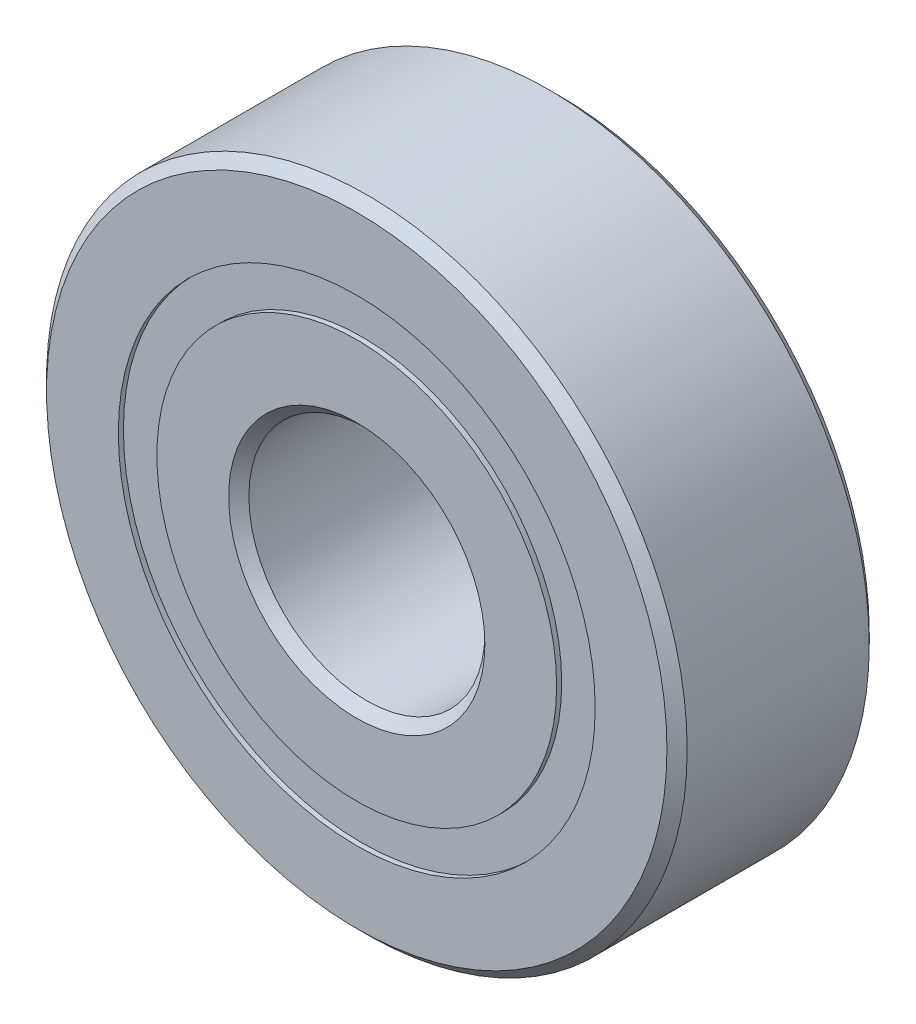
ISO-10303-21;
HEADER;
FILE_DESCRIPTION(('STEP AP214'),'2;1');
FILE_NAME('part.step','',(''),(''),'','','');
FILE_SCHEMA(('AUTOMOTIVE_DESIGN { 1 0 10303 214 1 1 1 1 }'));
ENDSEC;
DATA;
#1=APPLICATION_CONTEXT('core data for automotive mechanical design processes');
#2=APPLICATION_PROTOCOL_DEFINITION('international standard','automotive_design',2000,#1);
#3=PRODUCT_CONTEXT('',#1,'mechanical');
#4=PRODUCT('Part','Part','',(#3));
#5=PRODUCT_RELATED_PRODUCT_CATEGORY('part','',(#4));
#6=PRODUCT_DEFINITION_FORMATION('','',#4);
#7=PRODUCT_DEFINITION_CONTEXT('part definition',#1,'design');
#8=PRODUCT_DEFINITION('design','',#6,#7);
#9=PRODUCT_DEFINITION_SHAPE('','',#8);
#10=(LENGTH_UNIT() NAMED_UNIT(*) SI_UNIT(.MILLI.,.METRE.));
#11=(NAMED_UNIT(*) PLANE_ANGLE_UNIT() SI_UNIT($,.RADIAN.));
#12=(NAMED_UNIT(*) SI_UNIT($,.STERADIAN.) SOLID_ANGLE_UNIT());
#13=UNCERTAINTY_MEASURE_WITH_UNIT(LENGTH_MEASURE(1.E-05),#10,'distance_accuracy_value','');
#14=(GEOMETRIC_REPRESENTATION_CONTEXT(3) GLOBAL_UNCERTAINTY_ASSIGNED_CONTEXT((#13)) GLOBAL_UNIT_ASSIGNED_CONTEXT((#10,
#11,#12)) REPRESENTATION_CONTEXT('',''));
#15=CARTESIAN_POINT('',(0.,0.,0.));
#16=DIRECTION('',(0.,0.,1.));
#17=DIRECTION('',(1.,0.,0.));
#18=AXIS2_PLACEMENT_3D('',#15,#16,#17);
#19=CARTESIAN_POINT('',(0.,7.07142857142857,-2.85));
#20=DIRECTION('',(0.,0.,1.));
#21=DIRECTION('',(1.,0.,0.));
#22=AXIS2_PLACEMENT_3D('',#19,#20,#21);
#23=PLANE('',#22);
#24=CARTESIAN_POINT('',(0.,0.,-2.85));
#25=DIRECTION('',(0.,0.,1.));
#26=DIRECTION('',(1.,0.,0.));
#27=AXIS2_PLACEMENT_3D('',#24,#25,#26);
#28=CIRCLE('',#27,7.07142857142857);
#29=CARTESIAN_POINT('',(7.07142857142857,0.,-2.85));
#30=VERTEX_POINT('',#29);
#31=EDGE_CURVE('E65',#30,#30,#28,.T.);
#32=ORIENTED_EDGE('',*,*,#31,.F.);
#33=EDGE_LOOP('',(#32));
#34=FACE_BOUND('',#33,.T.);
#35=CARTESIAN_POINT('',(0.,0.,-2.85));
#36=DIRECTION('',(0.,0.,1.));
#37=DIRECTION('',(1.,0.,0.));
#38=AXIS2_PLACEMENT_3D('',#35,#36,#37);
#39=CIRCLE('',#38,5.92857142857143);
#40=CARTESIAN_POINT('',(5.92857142857143,0.,-2.85));
#41=VERTEX_POINT('',#40);
#42=EDGE_CURVE('E11',#41,#41,#39,.T.);
#43=ORIENTED_EDGE('',*,*,#42,.T.);
#44=EDGE_LOOP('',(#43));
#45=FACE_BOUND('',#44,.T.);
#46=ADVANCED_FACE('F48',(#34,#45),#23,.F.);
#47=CARTESIAN_POINT('',(0.,0.,3.));
#48=DIRECTION('',(0.,0.,1.));
#49=DIRECTION('',(1.,0.,0.));
#50=AXIS2_PLACEMENT_3D('',#47,#48,#49);
#51=CYLINDRICAL_SURFACE('',#50,5.92857142857143);
#52=ORIENTED_EDGE('',*,*,#42,.F.);
#53=EDGE_LOOP('',(#52));
#54=FACE_BOUND('',#53,.T.);
#55=CARTESIAN_POINT('',(0.,0.,-1.45062344873598));
#56=DIRECTION('',(0.,0.,1.));
#57=DIRECTION('',(1.,0.,0.));
#58=AXIS2_PLACEMENT_3D('',#55,#56,#57);
#59=CIRCLE('',#58,5.92857142857143);
#60=CARTESIAN_POINT('',(5.92857142857143,0.,-1.45062344873598));
#61=VERTEX_POINT('',#60);
#62=EDGE_CURVE('E55',#61,#61,#59,.T.);
#63=ORIENTED_EDGE('',*,*,#62,.T.);
#64=EDGE_LOOP('',(#63));
#65=FACE_BOUND('',#64,.T.);
#66=ADVANCED_FACE('F75',(#54,#65),#51,.F.);
#67=CARTESIAN_POINT('',(0.,7.07142857142857,-1.45062344873598));
#68=DIRECTION('',(0.,0.,-1.));
#69=DIRECTION('',(-1.,0.,0.));
#70=AXIS2_PLACEMENT_3D('',#67,#68,#69);
#71=PLANE('',#70);
#72=ORIENTED_EDGE('',*,*,#62,.F.);
#73=EDGE_LOOP('',(#72));
#74=FACE_BOUND('',#73,.T.);
#75=CARTESIAN_POINT('',(0.,0.,-1.45062344873598));
#76=DIRECTION('',(0.,0.,1.));
#77=DIRECTION('',(1.,0.,0.));
#78=AXIS2_PLACEMENT_3D('',#75,#76,#77);
#79=CIRCLE('',#78,7.07142857142857);
#80=CARTESIAN_POINT('',(7.07142857142857,0.,-1.45062344873598));
#81=VERTEX_POINT('',#80);
#82=EDGE_CURVE('E61',#81,#81,#79,.T.);
#83=ORIENTED_EDGE('',*,*,#82,.T.);
#84=EDGE_LOOP('',(#83));
#85=FACE_BOUND('',#84,.T.);
#86=ADVANCED_FACE('F79',(#74,#85),#71,.F.);
#87=CARTESIAN_POINT('',(0.,0.,3.));
#88=DIRECTION('',(0.,0.,1.));
#89=DIRECTION('',(1.,0.,0.));
#90=AXIS2_PLACEMENT_3D('',#87,#88,#89);
#91=CYLINDRICAL_SURFACE('',#90,7.07142857142857);
#92=ORIENTED_EDGE('',*,*,#82,.F.);
#93=EDGE_LOOP('',(#92));
#94=FACE_BOUND('',#93,.T.);
#95=ORIENTED_EDGE('',*,*,#31,.T.);
#96=EDGE_LOOP('',(#95));
#97=FACE_BOUND('',#96,.T.);
#98=ADVANCED_FACE('F72',(#94,#97),#91,.T.);
#99=CLOSED_SHELL('',(#46,#66,#86,#98));
#100=MANIFOLD_SOLID_BREP('B2',#99);
#101=CARTESIAN_POINT('',(0.,7.07142857142857,2.85));
#102=DIRECTION('',(0.,0.,-1.));
#103=DIRECTION('',(-1.,0.,0.));
#104=AXIS2_PLACEMENT_3D('',#101,#102,#103);
#105=PLANE('',#104);
#106=CARTESIAN_POINT('',(0.,0.,2.85));
#107=DIRECTION('',(0.,0.,1.));
#108=DIRECTION('',(1.,0.,0.));
#109=AXIS2_PLACEMENT_3D('',#106,#107,#108);
#110=CIRCLE('',#109,5.92857142857143);
#111=CARTESIAN_POINT('',(5.92857142857143,0.,2.85));
#112=VERTEX_POINT('',#111);
#113=EDGE_CURVE('E47',#112,#112,#110,.T.);
#114=ORIENTED_EDGE('',*,*,#113,.F.);
#115=EDGE_LOOP('',(#114));
#116=FACE_BOUND('',#115,.T.);
#117=CARTESIAN_POINT('',(0.,0.,2.85));
#118=DIRECTION('',(0.,0.,1.));
#119=DIRECTION('',(1.,0.,0.));
#120=AXIS2_PLACEMENT_3D('',#117,#118,#119);
#121=CIRCLE('',#120,7.07142857142857);
#122=CARTESIAN_POINT('',(7.07142857142857,0.,2.85));
#123=VERTEX_POINT('',#122);
#124=EDGE_CURVE('E138',#123,#123,#121,.T.);
#125=ORIENTED_EDGE('',*,*,#124,.T.);
#126=EDGE_LOOP('',(#125));
#127=FACE_BOUND('',#126,.T.);
#128=ADVANCED_FACE('F120',(#116,#127),#105,.F.);
#129=CARTESIAN_POINT('',(0.,0.,3.));
#130=DIRECTION('',(0.,0.,1.));
#131=DIRECTION('',(1.,0.,0.));
#132=AXIS2_PLACEMENT_3D('',#129,#130,#131);
#133=CYLINDRICAL_SURFACE('',#132,5.92857142857143);
#134=CARTESIAN_POINT('',(0.,0.,1.45062344873598));
#135=DIRECTION('',(0.,0.,1.));
#136=DIRECTION('',(1.,0.,0.));
#137=AXIS2_PLACEMENT_3D('',#134,#135,#136);
#138=CIRCLE('',#137,5.92857142857143);
#139=CARTESIAN_POINT('',(5.92857142857143,0.,1.45062344873598));
#140=VERTEX_POINT('',#139);
#141=EDGE_CURVE('E127',#140,#140,#138,.T.);
#142=ORIENTED_EDGE('',*,*,#141,.F.);
#143=EDGE_LOOP('',(#142));
#144=FACE_BOUND('',#143,.T.);
#145=ORIENTED_EDGE('',*,*,#113,.T.);
#146=EDGE_LOOP('',(#145));
#147=FACE_BOUND('',#146,.T.);
#148=ADVANCED_FACE('F153',(#144,#147),#133,.F.);
#149=CARTESIAN_POINT('',(0.,7.07142857142857,1.45062344873598));
#150=DIRECTION('',(0.,0.,1.));
#151=DIRECTION('',(1.,0.,0.));
#152=AXIS2_PLACEMENT_3D('',#149,#150,#151);
#153=PLANE('',#152);
#154=CARTESIAN_POINT('',(0.,0.,1.45062344873598));
#155=DIRECTION('',(0.,0.,1.));
#156=DIRECTION('',(1.,0.,0.));
#157=AXIS2_PLACEMENT_3D('',#154,#155,#156);
#158=CIRCLE('',#157,7.07142857142857);
#159=CARTESIAN_POINT('',(7.07142857142857,0.,1.45062344873598));
#160=VERTEX_POINT('',#159);
#161=EDGE_CURVE('E134',#160,#160,#158,.T.);
#162=ORIENTED_EDGE('',*,*,#161,.F.);
#163=EDGE_LOOP('',(#162));
#164=FACE_BOUND('',#163,.T.);
#165=ORIENTED_EDGE('',*,*,#141,.T.);
#166=EDGE_LOOP('',(#165));
#167=FACE_BOUND('',#166,.T.);
#168=ADVANCED_FACE('F148',(#164,#167),#153,.F.);
#169=CARTESIAN_POINT('',(0.,0.,3.));
#170=DIRECTION('',(0.,0.,1.));
#171=DIRECTION('',(1.,0.,0.));
#172=AXIS2_PLACEMENT_3D('',#169,#170,#171);
#173=CYLINDRICAL_SURFACE('',#172,7.07142857142857);
#174=ORIENTED_EDGE('',*,*,#124,.F.);
#175=EDGE_LOOP('',(#174));
#176=FACE_BOUND('',#175,.T.);
#177=ORIENTED_EDGE('',*,*,#161,.T.);
#178=EDGE_LOOP('',(#177));
#179=FACE_BOUND('',#178,.T.);
#180=ADVANCED_FACE('F145',(#176,#179),#173,.T.);
#181=CLOSED_SHELL('',(#128,#148,#168,#180));
#182=MANIFOLD_SOLID_BREP('B6',#181);
#183=CARTESIAN_POINT('',(-3.24999999999993,5.62916512459889,0.));
#184=DIRECTION('',(0.,0.,1.));
#185=DIRECTION('',(-0.499999999999989,0.866025403784445,0.));
#186=AXIS2_PLACEMENT_3D('',#183,#184,#185);
#187=SPHERICAL_SURFACE('',#186,1.45062344873598);
#188=CARTESIAN_POINT('',(-3.24999999999993,5.62916512459889,1.45062344873598));
#189=VERTEX_POINT('',#188);
#190=VERTEX_LOOP('',#189);
#191=FACE_BOUND('',#190,.T.);
#192=ADVANCED_FACE('F194',(#191),#187,.T.);
#193=CLOSED_SHELL('',(#192));
#194=MANIFOLD_SOLID_BREP('B42',#193);
#195=CARTESIAN_POINT('',(-5.62916512459881,3.25000000000007,0.));
#196=DIRECTION('',(0.,0.,1.));
#197=DIRECTION('',(-0.866025403784433,0.50000000000001,0.));
#198=AXIS2_PLACEMENT_3D('',#195,#196,#197);
#199=SPHERICAL_SURFACE('',#198,1.45062344873598);
#200=CARTESIAN_POINT('',(-5.62916512459881,3.25000000000007,1.45062344873598));
#201=VERTEX_POINT('',#200);
#202=VERTEX_LOOP('',#201);
#203=FACE_BOUND('',#202,.T.);
#204=ADVANCED_FACE('F215',(#203),#199,.T.);
#205=CLOSED_SHELL('',(#204));
#206=MANIFOLD_SOLID_BREP('B116',#205);
#207=CARTESIAN_POINT('',(-6.5,0.,0.));
#208=DIRECTION('',(0.,0.,1.));
#209=DIRECTION('',(-1.,0.,0.));
#210=AXIS2_PLACEMENT_3D('',#207,#208,#209);
#211=SPHERICAL_SURFACE('',#210,1.45062344873598);
#212=CARTESIAN_POINT('',(-6.5,0.,1.45062344873598));
#213=VERTEX_POINT('',#212);
#214=VERTEX_LOOP('',#213);
#215=FACE_BOUND('',#214,.T.);
#216=ADVANCED_FACE('F236',(#215),#211,.T.);
#217=CLOSED_SHELL('',(#216));
#218=MANIFOLD_SOLID_BREP('B190',#217);
#219=CARTESIAN_POINT('',(-5.62916512459888,-3.24999999999995,0.));
#220=DIRECTION('',(0.,0.,1.));
#221=DIRECTION('',(-0.866025403784443,-0.499999999999992,0.));
#222=AXIS2_PLACEMENT_3D('',#219,#220,#221);
#223=SPHERICAL_SURFACE('',#222,1.45062344873598);
#224=CARTESIAN_POINT('',(-5.62916512459888,-3.24999999999995,1.45062344873598));
#225=VERTEX_POINT('',#224);
#226=VERTEX_LOOP('',#225);
#227=FACE_BOUND('',#226,.T.);
#228=ADVANCED_FACE('F257',(#227),#223,.T.);
#229=CLOSED_SHELL('',(#228));
#230=MANIFOLD_SOLID_BREP('B211',#229);
#231=CARTESIAN_POINT('',(-3.25000000000005,-5.62916512459882,0.));
#232=DIRECTION('',(0.,0.,1.));
#233=DIRECTION('',(-0.500000000000007,-0.866025403784435,0.));
#234=AXIS2_PLACEMENT_3D('',#231,#232,#233);
#235=SPHERICAL_SURFACE('',#234,1.45062344873598);
#236=CARTESIAN_POINT('',(-3.25000000000005,-5.62916512459882,1.45062344873598));
#237=VERTEX_POINT('',#236);
#238=VERTEX_LOOP('',#237);
#239=FACE_BOUND('',#238,.T.);
#240=ADVANCED_FACE('F278',(#239),#235,.T.);
#241=CLOSED_SHELL('',(#240));
#242=MANIFOLD_SOLID_BREP('B232',#241);
#243=CARTESIAN_POINT('',(0.,-6.5,0.));
#244=DIRECTION('',(0.,0.,1.));
#245=DIRECTION('',(0.,-1.,0.));
#246=AXIS2_PLACEMENT_3D('',#243,#244,#245);
#247=SPHERICAL_SURFACE('',#246,1.45062344873598);
#248=CARTESIAN_POINT('',(0.,-6.5,1.45062344873598));
#249=VERTEX_POINT('',#248);
#250=VERTEX_LOOP('',#249);
#251=FACE_BOUND('',#250,.T.);
#252=ADVANCED_FACE('F299',(#251),#247,.T.);
#253=CLOSED_SHELL('',(#252));
#254=MANIFOLD_SOLID_BREP('B253',#253);
#255=CARTESIAN_POINT('',(3.24999999999997,-5.62916512459887,0.));
#256=DIRECTION('',(0.,0.,1.));
#257=DIRECTION('',(0.499999999999995,-0.866025403784442,0.));
#258=AXIS2_PLACEMENT_3D('',#255,#256,#257);
#259=SPHERICAL_SURFACE('',#258,1.45062344873598);
#260=CARTESIAN_POINT('',(3.24999999999997,-5.62916512459887,1.45062344873598));
#261=VERTEX_POINT('',#260);
#262=VERTEX_LOOP('',#261);
#263=FACE_BOUND('',#262,.T.);
#264=ADVANCED_FACE('F320',(#263),#259,.T.);
#265=CLOSED_SHELL('',(#264));
#266=MANIFOLD_SOLID_BREP('B274',#265);
#267=CARTESIAN_POINT('',(5.62916512459884,-3.25000000000003,0.));
#268=DIRECTION('',(0.,0.,1.));
#269=DIRECTION('',(0.866025403784436,-0.500000000000004,0.));
#270=AXIS2_PLACEMENT_3D('',#267,#268,#269);
#271=SPHERICAL_SURFACE('',#270,1.45062344873598);
#272=CARTESIAN_POINT('',(5.62916512459884,-3.25000000000003,1.45062344873598));
#273=VERTEX_POINT('',#272);
#274=VERTEX_LOOP('',#273);
#275=FACE_BOUND('',#274,.T.);
#276=ADVANCED_FACE('F341',(#275),#271,.T.);
#277=CLOSED_SHELL('',(#276));
#278=MANIFOLD_SOLID_BREP('B295',#277);
#279=CARTESIAN_POINT('',(6.5,0.,0.));
#280=DIRECTION('',(0.,0.,1.));
#281=DIRECTION('',(1.,0.,0.));
#282=AXIS2_PLACEMENT_3D('',#279,#280,#281);
#283=SPHERICAL_SURFACE('',#282,1.45062344873598);
#284=CARTESIAN_POINT('',(6.5,0.,1.45062344873598));
#285=VERTEX_POINT('',#284);
#286=VERTEX_LOOP('',#285);
#287=FACE_BOUND('',#286,.T.);
#288=ADVANCED_FACE('F362',(#287),#283,.T.);
#289=CLOSED_SHELL('',(#288));
#290=MANIFOLD_SOLID_BREP('B316',#289);
#291=CARTESIAN_POINT('',(5.62916512459886,3.24999999999999,0.));
#292=DIRECTION('',(0.,0.,1.));
#293=DIRECTION('',(0.86602540378444,0.499999999999998,0.));
#294=AXIS2_PLACEMENT_3D('',#291,#292,#293);
#295=SPHERICAL_SURFACE('',#294,1.45062344873598);
#296=CARTESIAN_POINT('',(5.62916512459886,3.24999999999999,1.45062344873598));
#297=VERTEX_POINT('',#296);
#298=VERTEX_LOOP('',#297);
#299=FACE_BOUND('',#298,.T.);
#300=ADVANCED_FACE('F383',(#299),#295,.T.);
#301=CLOSED_SHELL('',(#300));
#302=MANIFOLD_SOLID_BREP('B337',#301);
#303=CARTESIAN_POINT('',(3.25000000000001,5.62916512459885,0.));
#304=DIRECTION('',(0.,0.,1.));
#305=DIRECTION('',(0.500000000000001,0.866025403784438,0.));
#306=AXIS2_PLACEMENT_3D('',#303,#304,#305);
#307=SPHERICAL_SURFACE('',#306,1.45062344873598);
#308=CARTESIAN_POINT('',(3.25000000000001,5.62916512459885,1.45062344873598));
#309=VERTEX_POINT('',#308);
#310=VERTEX_LOOP('',#309);
#311=FACE_BOUND('',#310,.T.);
#312=ADVANCED_FACE('F404',(#311),#307,.T.);
#313=CLOSED_SHELL('',(#312));
#314=MANIFOLD_SOLID_BREP('B358',#313);
#315=CARTESIAN_POINT('',(0.,6.5,0.));
#316=DIRECTION('',(0.,0.,1.));
#317=DIRECTION('',(0.,1.,0.));
#318=AXIS2_PLACEMENT_3D('',#315,#316,#317);
#319=SPHERICAL_SURFACE('',#318,1.45062344873598);
#320=CARTESIAN_POINT('',(0.,6.5,1.45062344873598));
#321=VERTEX_POINT('',#320);
#322=VERTEX_LOOP('',#321);
#323=FACE_BOUND('',#322,.T.);
#324=ADVANCED_FACE('F427',(#323),#319,.T.);
#325=CLOSED_SHELL('',(#324));
#326=MANIFOLD_SOLID_BREP('B379',#325);
#327=CARTESIAN_POINT('',(0.,5.92857142857143,3.));
#328=DIRECTION('',(0.,0.,-1.));
#329=DIRECTION('',(-1.,0.,0.));
#330=AXIS2_PLACEMENT_3D('',#327,#328,#329);
#331=PLANE('',#330);
#332=CARTESIAN_POINT('',(0.,0.,3.));
#333=DIRECTION('',(0.,0.,1.));
#334=DIRECTION('',(1.,0.,0.));
#335=AXIS2_PLACEMENT_3D('',#332,#333,#334);
#336=CIRCLE('',#335,3.8);
#337=CARTESIAN_POINT('',(3.8,0.,3.));
#338=VERTEX_POINT('',#337);
#339=EDGE_CURVE('E482',#338,#338,#336,.T.);
#340=ORIENTED_EDGE('',*,*,#339,.F.);
#341=EDGE_LOOP('',(#340));
#342=FACE_BOUND('',#341,.T.);
#343=CARTESIAN_POINT('',(0.,0.,3.));
#344=DIRECTION('',(0.,0.,1.));
#345=DIRECTION('',(1.,0.,0.));
#346=AXIS2_PLACEMENT_3D('',#343,#344,#345);
#347=CIRCLE('',#346,5.92857142857143);
#348=CARTESIAN_POINT('',(5.92857142857143,0.,3.));
#349=VERTEX_POINT('',#348);
#350=EDGE_CURVE('E426',#349,#349,#347,.T.);
#351=ORIENTED_EDGE('',*,*,#350,.T.);
#352=EDGE_LOOP('',(#351));
#353=FACE_BOUND('',#352,.T.);
#354=ADVANCED_FACE('F447',(#342,#353),#331,.F.);
#355=CARTESIAN_POINT('',(0.,0.,3.));
#356=DIRECTION('',(0.,0.,1.));
#357=DIRECTION('',(1.,0.,0.));
#358=AXIS2_PLACEMENT_3D('',#355,#356,#357);
#359=CYLINDRICAL_SURFACE('',#358,5.92857142857143);
#360=ORIENTED_EDGE('',*,*,#350,.F.);
#361=EDGE_LOOP('',(#360));
#362=FACE_BOUND('',#361,.T.);
#363=CARTESIAN_POINT('',(0.,0.,1.33333333333333));
#364=DIRECTION('',(0.,0.,1.));
#365=DIRECTION('',(1.,0.,0.));
#366=AXIS2_PLACEMENT_3D('',#363,#364,#365);
#367=CIRCLE('',#366,5.92857142857143);
#368=CARTESIAN_POINT('',(5.92857142857143,0.,1.33333333333333));
#369=VERTEX_POINT('',#368);
#370=EDGE_CURVE('E454',#369,#369,#367,.T.);
#371=ORIENTED_EDGE('',*,*,#370,.T.);
#372=EDGE_LOOP('',(#371));
#373=FACE_BOUND('',#372,.T.);
#374=ADVANCED_FACE('F490',(#362,#373),#359,.T.);
#375=CARTESIAN_POINT('',(0.,0.,0.));
#376=DIRECTION('',(0.,0.,1.));
#377=DIRECTION('',(1.,0.,0.));
#378=AXIS2_PLACEMENT_3D('',#375,#376,#377);
#379=TOROIDAL_SURFACE('',#378,6.49999999999999,1.45062344873598);
#380=ORIENTED_EDGE('',*,*,#370,.F.);
#381=EDGE_LOOP('',(#380));
#382=FACE_BOUND('',#381,.T.);
#383=CARTESIAN_POINT('',(0.,0.,-1.33333333333333));
#384=DIRECTION('',(0.,0.,1.));
#385=DIRECTION('',(1.,0.,0.));
#386=AXIS2_PLACEMENT_3D('',#383,#384,#385);
#387=CIRCLE('',#386,5.92857142857143);
#388=CARTESIAN_POINT('',(5.92857142857143,0.,-1.33333333333333));
#389=VERTEX_POINT('',#388);
#390=EDGE_CURVE('E459',#389,#389,#387,.T.);
#391=ORIENTED_EDGE('',*,*,#390,.T.);
#392=EDGE_LOOP('',(#391));
#393=FACE_BOUND('',#392,.T.);
#394=ADVANCED_FACE('F494',(#382,#393),#379,.F.);
#395=CARTESIAN_POINT('',(0.,0.,3.));
#396=DIRECTION('',(0.,0.,1.));
#397=DIRECTION('',(1.,0.,0.));
#398=AXIS2_PLACEMENT_3D('',#395,#396,#397);
#399=CYLINDRICAL_SURFACE('',#398,5.92857142857143);
#400=ORIENTED_EDGE('',*,*,#390,.F.);
#401=EDGE_LOOP('',(#400));
#402=FACE_BOUND('',#401,.T.);
#403=CARTESIAN_POINT('',(0.,0.,-3.));
#404=DIRECTION('',(0.,0.,1.));
#405=DIRECTION('',(1.,0.,0.));
#406=AXIS2_PLACEMENT_3D('',#403,#404,#405);
#407=CIRCLE('',#406,5.92857142857143);
#408=CARTESIAN_POINT('',(5.92857142857143,0.,-3.));
#409=VERTEX_POINT('',#408);
#410=EDGE_CURVE('E464',#409,#409,#407,.T.);
#411=ORIENTED_EDGE('',*,*,#410,.T.);
#412=EDGE_LOOP('',(#411));
#413=FACE_BOUND('',#412,.T.);
#414=ADVANCED_FACE('F499',(#402,#413),#399,.T.);
#415=CARTESIAN_POINT('',(0.,3.8,-3.));
#416=DIRECTION('',(0.,0.,1.));
#417=DIRECTION('',(1.,0.,0.));
#418=AXIS2_PLACEMENT_3D('',#415,#416,#417);
#419=PLANE('',#418);
#420=ORIENTED_EDGE('',*,*,#410,.F.);
#421=EDGE_LOOP('',(#420));
#422=FACE_BOUND('',#421,.T.);
#423=CARTESIAN_POINT('',(0.,0.,-3.));
#424=DIRECTION('',(0.,0.,1.));
#425=DIRECTION('',(1.,0.,0.));
#426=AXIS2_PLACEMENT_3D('',#423,#424,#425);
#427=CIRCLE('',#426,3.8);
#428=CARTESIAN_POINT('',(3.8,0.,-3.));
#429=VERTEX_POINT('',#428);
#430=EDGE_CURVE('E470',#429,#429,#427,.T.);
#431=ORIENTED_EDGE('',*,*,#430,.T.);
#432=EDGE_LOOP('',(#431));
#433=FACE_BOUND('',#432,.T.);
#434=ADVANCED_FACE('F505',(#422,#433),#419,.F.);
#435=CARTESIAN_POINT('',(0.,0.,-2.7));
#436=DIRECTION('',(0.,0.,-1.));
#437=DIRECTION('',(-1.,0.,0.));
#438=AXIS2_PLACEMENT_3D('',#435,#436,#437);
#439=CONICAL_SURFACE('',#438,3.5,0.78539816339745);
#440=ORIENTED_EDGE('',*,*,#430,.F.);
#441=EDGE_LOOP('',(#440));
#442=FACE_BOUND('',#441,.T.);
#443=CARTESIAN_POINT('',(0.,0.,-2.7));
#444=DIRECTION('',(0.,0.,1.));
#445=DIRECTION('',(1.,0.,0.));
#446=AXIS2_PLACEMENT_3D('',#443,#444,#445);
#447=CIRCLE('',#446,3.5);
#448=CARTESIAN_POINT('',(3.5,0.,-2.7));
#449=VERTEX_POINT('',#448);
#450=EDGE_CURVE('E474',#449,#449,#447,.T.);
#451=ORIENTED_EDGE('',*,*,#450,.T.);
#452=EDGE_LOOP('',(#451));
#453=FACE_BOUND('',#452,.T.);
#454=ADVANCED_FACE('F509',(#442,#453),#439,.F.);
#455=CARTESIAN_POINT('',(0.,0.,3.));
#456=DIRECTION('',(0.,0.,1.));
#457=DIRECTION('',(1.,0.,0.));
#458=AXIS2_PLACEMENT_3D('',#455,#456,#457);
#459=CYLINDRICAL_SURFACE('',#458,3.5);
#460=ORIENTED_EDGE('',*,*,#450,.F.);
#461=EDGE_LOOP('',(#460));
#462=FACE_BOUND('',#461,.T.);
#463=CARTESIAN_POINT('',(0.,0.,2.7));
#464=DIRECTION('',(0.,0.,1.));
#465=DIRECTION('',(1.,0.,0.));
#466=AXIS2_PLACEMENT_3D('',#463,#464,#465);
#467=CIRCLE('',#466,3.5);
#468=CARTESIAN_POINT('',(3.5,0.,2.7));
#469=VERTEX_POINT('',#468);
#470=EDGE_CURVE('E478',#469,#469,#467,.T.);
#471=ORIENTED_EDGE('',*,*,#470,.T.);
#472=EDGE_LOOP('',(#471));
#473=FACE_BOUND('',#472,.T.);
#474=ADVANCED_FACE('F513',(#462,#473),#459,.F.);
#475=CARTESIAN_POINT('',(0.,0.,3.));
#476=DIRECTION('',(0.,0.,1.));
#477=DIRECTION('',(1.,0.,0.));
#478=AXIS2_PLACEMENT_3D('',#475,#476,#477);
#479=CONICAL_SURFACE('',#478,3.8,0.785398163397443);
#480=ORIENTED_EDGE('',*,*,#470,.F.);
#481=EDGE_LOOP('',(#480));
#482=FACE_BOUND('',#481,.T.);
#483=ORIENTED_EDGE('',*,*,#339,.T.);
#484=EDGE_LOOP('',(#483));
#485=FACE_BOUND('',#484,.T.);
#486=ADVANCED_FACE('F487',(#482,#485),#479,.F.);
#487=CLOSED_SHELL('',(#354,#374,#394,#414,#434,#454,#474,#486));
#488=MANIFOLD_SOLID_BREP('B400',#487);
#489=CARTESIAN_POINT('',(0.,0.,2.7));
#490=DIRECTION('',(0.,0.,-1.));
#491=DIRECTION('',(-1.,0.,0.));
#492=AXIS2_PLACEMENT_3D('',#489,#490,#491);
#493=CONICAL_SURFACE('',#492,9.5,0.785398163397448);
#494=CARTESIAN_POINT('',(0.,0.,3.));
#495=DIRECTION('',(0.,0.,1.));
#496=DIRECTION('',(1.,0.,0.));
#497=AXIS2_PLACEMENT_3D('',#494,#495,#496);
#498=CIRCLE('',#497,9.2);
#499=CARTESIAN_POINT('',(9.2,0.,3.));
#500=VERTEX_POINT('',#499);
#501=EDGE_CURVE('E616',#500,#500,#498,.T.);
#502=ORIENTED_EDGE('',*,*,#501,.F.);
#503=EDGE_LOOP('',(#502));
#504=FACE_BOUND('',#503,.T.);
#505=CARTESIAN_POINT('',(0.,0.,2.7));
#506=DIRECTION('',(0.,0.,1.));
#507=DIRECTION('',(1.,0.,0.));
#508=AXIS2_PLACEMENT_3D('',#505,#506,#507);
#509=CIRCLE('',#508,9.5);
#510=CARTESIAN_POINT('',(9.5,0.,2.7));
#511=VERTEX_POINT('',#510);
#512=EDGE_CURVE('E446',#511,#511,#509,.T.);
#513=ORIENTED_EDGE('',*,*,#512,.T.);
#514=EDGE_LOOP('',(#513));
#515=FACE_BOUND('',#514,.T.);
#516=ADVANCED_FACE('F580',(#504,#515),#493,.T.);
#517=CARTESIAN_POINT('',(0.,0.,3.));
#518=DIRECTION('',(0.,0.,1.));
#519=DIRECTION('',(1.,0.,0.));
#520=AXIS2_PLACEMENT_3D('',#517,#518,#519);
#521=CYLINDRICAL_SURFACE('',#520,9.5);
#522=ORIENTED_EDGE('',*,*,#512,.F.);
#523=EDGE_LOOP('',(#522));
#524=FACE_BOUND('',#523,.T.);
#525=CARTESIAN_POINT('',(0.,0.,-2.7));
#526=DIRECTION('',(0.,0.,1.));
#527=DIRECTION('',(1.,0.,0.));
#528=AXIS2_PLACEMENT_3D('',#525,#526,#527);
#529=CIRCLE('',#528,9.5);
#530=CARTESIAN_POINT('',(9.5,0.,-2.7));
#531=VERTEX_POINT('',#530);
#532=EDGE_CURVE('E587',#531,#531,#529,.T.);
#533=ORIENTED_EDGE('',*,*,#532,.T.);
#534=EDGE_LOOP('',(#533));
#535=FACE_BOUND('',#534,.T.);
#536=ADVANCED_FACE('F623',(#524,#535),#521,.T.);
#537=CARTESIAN_POINT('',(0.,0.,-3.));
#538=DIRECTION('',(0.,0.,1.));
#539=DIRECTION('',(1.,0.,0.));
#540=AXIS2_PLACEMENT_3D('',#537,#538,#539);
#541=CONICAL_SURFACE('',#540,9.2,0.785398163397448);
#542=ORIENTED_EDGE('',*,*,#532,.F.);
#543=EDGE_LOOP('',(#542));
#544=FACE_BOUND('',#543,.T.);
#545=CARTESIAN_POINT('',(0.,0.,-3.));
#546=DIRECTION('',(0.,0.,1.));
#547=DIRECTION('',(1.,0.,0.));
#548=AXIS2_PLACEMENT_3D('',#545,#546,#547);
#549=CIRCLE('',#548,9.2);
#550=CARTESIAN_POINT('',(9.2,0.,-3.));
#551=VERTEX_POINT('',#550);
#552=EDGE_CURVE('E594',#551,#551,#549,.T.);
#553=ORIENTED_EDGE('',*,*,#552,.T.);
#554=EDGE_LOOP('',(#553));
#555=FACE_BOUND('',#554,.T.);
#556=ADVANCED_FACE('F627',(#544,#555),#541,.T.);
#557=CARTESIAN_POINT('',(0.,9.2,-3.));
#558=DIRECTION('',(0.,0.,1.));
#559=DIRECTION('',(1.,0.,0.));
#560=AXIS2_PLACEMENT_3D('',#557,#558,#559);
#561=PLANE('',#560);
#562=ORIENTED_EDGE('',*,*,#552,.F.);
#563=EDGE_LOOP('',(#562));
#564=FACE_BOUND('',#563,.T.);
#565=CARTESIAN_POINT('',(0.,0.,-3.));
#566=DIRECTION('',(0.,0.,1.));
#567=DIRECTION('',(1.,0.,0.));
#568=AXIS2_PLACEMENT_3D('',#565,#566,#567);
#569=CIRCLE('',#568,7.07142857142857);
#570=CARTESIAN_POINT('',(7.07142857142857,0.,-3.));
#571=VERTEX_POINT('',#570);
#572=EDGE_CURVE('E599',#571,#571,#569,.T.);
#573=ORIENTED_EDGE('',*,*,#572,.T.);
#574=EDGE_LOOP('',(#573));
#575=FACE_BOUND('',#574,.T.);
#576=ADVANCED_FACE('F632',(#564,#575),#561,.F.);
#577=CARTESIAN_POINT('',(0.,0.,3.));
#578=DIRECTION('',(0.,0.,1.));
#579=DIRECTION('',(1.,0.,0.));
#580=AXIS2_PLACEMENT_3D('',#577,#578,#579);
#581=CYLINDRICAL_SURFACE('',#580,7.07142857142857);
#582=ORIENTED_EDGE('',*,*,#572,.F.);
#583=EDGE_LOOP('',(#582));
#584=FACE_BOUND('',#583,.T.);
#585=CARTESIAN_POINT('',(0.,0.,-1.33333333333333));
#586=DIRECTION('',(0.,0.,1.));
#587=DIRECTION('',(1.,0.,0.));
#588=AXIS2_PLACEMENT_3D('',#585,#586,#587);
#589=CIRCLE('',#588,7.07142857142857);
#590=CARTESIAN_POINT('',(7.07142857142857,0.,-1.33333333333333));
#591=VERTEX_POINT('',#590);
#592=EDGE_CURVE('E605',#591,#591,#589,.T.);
#593=ORIENTED_EDGE('',*,*,#592,.T.);
#594=EDGE_LOOP('',(#593));
#595=FACE_BOUND('',#594,.T.);
#596=ADVANCED_FACE('F638',(#584,#595),#581,.F.);
#597=CARTESIAN_POINT('',(0.,0.,0.));
#598=DIRECTION('',(0.,0.,1.));
#599=DIRECTION('',(1.,0.,0.));
#600=AXIS2_PLACEMENT_3D('',#597,#598,#599);
#601=TOROIDAL_SURFACE('',#600,6.5,1.45062344873598);
#602=ORIENTED_EDGE('',*,*,#592,.F.);
#603=EDGE_LOOP('',(#602));
#604=FACE_BOUND('',#603,.T.);
#605=CARTESIAN_POINT('',(0.,0.,1.33333333333333));
#606=DIRECTION('',(0.,0.,1.));
#607=DIRECTION('',(1.,0.,0.));
#608=AXIS2_PLACEMENT_3D('',#605,#606,#607);
#609=CIRCLE('',#608,7.07142857142857);
#610=CARTESIAN_POINT('',(7.07142857142857,0.,1.33333333333333));
#611=VERTEX_POINT('',#610);
#612=EDGE_CURVE('E608',#611,#611,#609,.T.);
#613=ORIENTED_EDGE('',*,*,#612,.T.);
#614=EDGE_LOOP('',(#613));
#615=FACE_BOUND('',#614,.T.);
#616=ADVANCED_FACE('F642',(#604,#615),#601,.F.);
#617=CARTESIAN_POINT('',(0.,0.,3.));
#618=DIRECTION('',(0.,0.,1.));
#619=DIRECTION('',(1.,0.,0.));
#620=AXIS2_PLACEMENT_3D('',#617,#618,#619);
#621=CYLINDRICAL_SURFACE('',#620,7.07142857142857);
#622=ORIENTED_EDGE('',*,*,#612,.F.);
#623=EDGE_LOOP('',(#622));
#624=FACE_BOUND('',#623,.T.);
#625=CARTESIAN_POINT('',(0.,0.,3.));
#626=DIRECTION('',(0.,0.,1.));
#627=DIRECTION('',(1.,0.,0.));
#628=AXIS2_PLACEMENT_3D('',#625,#626,#627);
#629=CIRCLE('',#628,7.07142857142857);
#630=CARTESIAN_POINT('',(7.07142857142857,0.,3.));
#631=VERTEX_POINT('',#630);
#632=EDGE_CURVE('E612',#631,#631,#629,.T.);
#633=ORIENTED_EDGE('',*,*,#632,.T.);
#634=EDGE_LOOP('',(#633));
#635=FACE_BOUND('',#634,.T.);
#636=ADVANCED_FACE('F646',(#624,#635),#621,.F.);
#637=CARTESIAN_POINT('',(0.,9.2,3.));
#638=DIRECTION('',(0.,0.,-1.));
#639=DIRECTION('',(-1.,0.,0.));
#640=AXIS2_PLACEMENT_3D('',#637,#638,#639);
#641=PLANE('',#640);
#642=ORIENTED_EDGE('',*,*,#632,.F.);
#643=EDGE_LOOP('',(#642));
#644=FACE_BOUND('',#643,.T.);
#645=ORIENTED_EDGE('',*,*,#501,.T.);
#646=EDGE_LOOP('',(#645));
#647=FACE_BOUND('',#646,.T.);
#648=ADVANCED_FACE('F620',(#644,#647),#641,.F.);
#649=CLOSED_SHELL('',(#516,#536,#556,#576,#596,#616,#636,#648));
#650=MANIFOLD_SOLID_BREP('B421',#649);
#651=ADVANCED_BREP_SHAPE_REPRESENTATION('',(#18,#100,#182,#194,#206,#218,#230,#242,#254,#266,
#278,#290,#302,#314,#326,#488,#650),#14);
#652=SHAPE_DEFINITION_REPRESENTATION(#9,#651);
ENDSEC;
END-ISO-10303-21;
